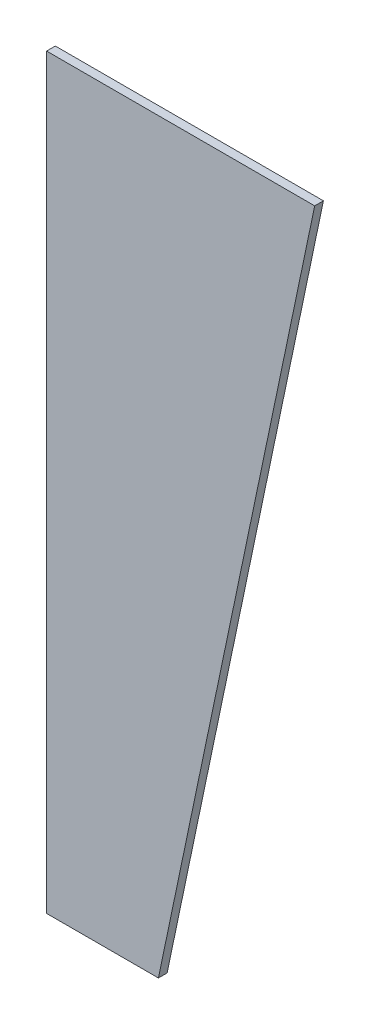
ISO-10303-21;
HEADER;
FILE_DESCRIPTION(('STEP AP214'),'2;1');
FILE_NAME('part.step','',(''),(''),'','','');
FILE_SCHEMA(('AUTOMOTIVE_DESIGN { 1 0 10303 214 1 1 1 1 }'));
ENDSEC;
DATA;
#1=APPLICATION_CONTEXT('core data for automotive mechanical design processes');
#2=APPLICATION_PROTOCOL_DEFINITION('international standard','automotive_design',2000,#1);
#3=PRODUCT_CONTEXT('',#1,'mechanical');
#4=PRODUCT('Part','Part','',(#3));
#5=PRODUCT_RELATED_PRODUCT_CATEGORY('part','',(#4));
#6=PRODUCT_DEFINITION_FORMATION('','',#4);
#7=PRODUCT_DEFINITION_CONTEXT('part definition',#1,'design');
#8=PRODUCT_DEFINITION('design','',#6,#7);
#9=PRODUCT_DEFINITION_SHAPE('','',#8);
#10=(LENGTH_UNIT() NAMED_UNIT(*) SI_UNIT(.MILLI.,.METRE.));
#11=(NAMED_UNIT(*) PLANE_ANGLE_UNIT() SI_UNIT($,.RADIAN.));
#12=(NAMED_UNIT(*) SI_UNIT($,.STERADIAN.) SOLID_ANGLE_UNIT());
#13=UNCERTAINTY_MEASURE_WITH_UNIT(LENGTH_MEASURE(1.E-05),#10,'distance_accuracy_value','');
#14=(GEOMETRIC_REPRESENTATION_CONTEXT(3) GLOBAL_UNCERTAINTY_ASSIGNED_CONTEXT((#13)) GLOBAL_UNIT_ASSIGNED_CONTEXT((#10,
#11,#12)) REPRESENTATION_CONTEXT('',''));
#15=CARTESIAN_POINT('',(0.,0.,0.));
#16=DIRECTION('',(0.,0.,1.));
#17=DIRECTION('',(1.,0.,0.));
#18=AXIS2_PLACEMENT_3D('',#15,#16,#17);
#19=CARTESIAN_POINT('',(0.,257.,3.));
#20=DIRECTION('',(0.,1.,0.));
#21=DIRECTION('',(0.,0.,1.));
#22=AXIS2_PLACEMENT_3D('',#19,#20,#21);
#23=PLANE('',#22);
#24=DIRECTION('',(1.,0.,0.));
#25=VECTOR('',#24,1.);
#26=CARTESIAN_POINT('',(0.,257.,0.));
#27=LINE('',#26,#25);
#28=CARTESIAN_POINT('',(0.,257.,0.));
#29=VERTEX_POINT('',#28);
#30=CARTESIAN_POINT('',(92.26,257.,0.));
#31=VERTEX_POINT('',#30);
#32=EDGE_CURVE('E97',#29,#31,#27,.T.);
#33=ORIENTED_EDGE('',*,*,#32,.F.);
#34=DIRECTION('',(0.,0.,-1.));
#35=VECTOR('',#34,1.);
#36=CARTESIAN_POINT('',(0.,257.,3.));
#37=LINE('',#36,#35);
#38=CARTESIAN_POINT('',(0.,257.,3.));
#39=VERTEX_POINT('',#38);
#40=EDGE_CURVE('E11',#39,#29,#37,.T.);
#41=ORIENTED_EDGE('',*,*,#40,.F.);
#42=DIRECTION('',(1.,0.,0.));
#43=VECTOR('',#42,1.);
#44=CARTESIAN_POINT('',(0.,257.,3.));
#45=LINE('',#44,#43);
#46=CARTESIAN_POINT('',(92.26,257.,3.));
#47=VERTEX_POINT('',#46);
#48=EDGE_CURVE('E91',#39,#47,#45,.T.);
#49=ORIENTED_EDGE('',*,*,#48,.T.);
#50=DIRECTION('',(0.,0.,-1.));
#51=VECTOR('',#50,1.);
#52=CARTESIAN_POINT('',(92.26,257.,3.));
#53=LINE('',#52,#51);
#54=EDGE_CURVE('E72',#47,#31,#53,.T.);
#55=ORIENTED_EDGE('',*,*,#54,.T.);
#56=EDGE_LOOP('',(#33,#41,#49,#55));
#57=FACE_BOUND('',#56,.T.);
#58=ADVANCED_FACE('F34',(#57),#23,.T.);
#59=CARTESIAN_POINT('',(0.,0.,3.));
#60=DIRECTION('',(-1.,0.,0.));
#61=DIRECTION('',(0.,0.,1.));
#62=AXIS2_PLACEMENT_3D('',#59,#60,#61);
#63=PLANE('',#62);
#64=DIRECTION('',(0.,1.,0.));
#65=VECTOR('',#64,1.);
#66=CARTESIAN_POINT('',(0.,0.,0.));
#67=LINE('',#66,#65);
#68=CARTESIAN_POINT('',(0.,0.,0.));
#69=VERTEX_POINT('',#68);
#70=EDGE_CURVE('E85',#69,#29,#67,.T.);
#71=ORIENTED_EDGE('',*,*,#70,.F.);
#72=DIRECTION('',(0.,0.,-1.));
#73=VECTOR('',#72,1.);
#74=CARTESIAN_POINT('',(0.,0.,3.));
#75=LINE('',#74,#73);
#76=CARTESIAN_POINT('',(0.,0.,3.));
#77=VERTEX_POINT('',#76);
#78=EDGE_CURVE('E42',#77,#69,#75,.T.);
#79=ORIENTED_EDGE('',*,*,#78,.F.);
#80=DIRECTION('',(0.,1.,0.));
#81=VECTOR('',#80,1.);
#82=CARTESIAN_POINT('',(0.,0.,3.));
#83=LINE('',#82,#81);
#84=EDGE_CURVE('E83',#77,#39,#83,.T.);
#85=ORIENTED_EDGE('',*,*,#84,.T.);
#86=ORIENTED_EDGE('',*,*,#40,.T.);
#87=EDGE_LOOP('',(#71,#79,#85,#86));
#88=FACE_BOUND('',#87,.T.);
#89=ADVANCED_FACE('F81',(#88),#63,.T.);
#90=CARTESIAN_POINT('',(0.,0.,3.));
#91=DIRECTION('',(0.,1.,0.));
#92=DIRECTION('',(0.,0.,1.));
#93=AXIS2_PLACEMENT_3D('',#90,#91,#92);
#94=PLANE('',#93);
#95=DIRECTION('',(1.,0.,0.));
#96=VECTOR('',#95,1.);
#97=CARTESIAN_POINT('',(0.,0.,0.));
#98=LINE('',#97,#96);
#99=CARTESIAN_POINT('',(38.48,0.,0.));
#100=VERTEX_POINT('',#99);
#101=EDGE_CURVE('E65',#69,#100,#98,.T.);
#102=ORIENTED_EDGE('',*,*,#101,.T.);
#103=DIRECTION('',(0.,0.,-1.));
#104=VECTOR('',#103,1.);
#105=CARTESIAN_POINT('',(38.48,0.,3.));
#106=LINE('',#105,#104);
#107=CARTESIAN_POINT('',(38.48,0.,3.));
#108=VERTEX_POINT('',#107);
#109=EDGE_CURVE('E86',#108,#100,#106,.T.);
#110=ORIENTED_EDGE('',*,*,#109,.F.);
#111=DIRECTION('',(1.,0.,0.));
#112=VECTOR('',#111,1.);
#113=CARTESIAN_POINT('',(0.,0.,3.));
#114=LINE('',#113,#112);
#115=EDGE_CURVE('E87',#77,#108,#114,.T.);
#116=ORIENTED_EDGE('',*,*,#115,.F.);
#117=ORIENTED_EDGE('',*,*,#78,.T.);
#118=EDGE_LOOP('',(#102,#110,#116,#117));
#119=FACE_BOUND('',#118,.T.);
#120=ADVANCED_FACE('F88',(#119),#94,.F.);
#121=CARTESIAN_POINT('',(36.865651614367,-7.71453207712318,3.));
#122=DIRECTION('',(-0.978798794122388,0.204824121198062,0.));
#123=DIRECTION('',(-0.204824121198062,-0.978798794122388,0.));
#124=AXIS2_PLACEMENT_3D('',#121,#122,#123);
#125=PLANE('',#124);
#126=DIRECTION('',(0.204824121198062,0.978798794122388,0.));
#127=VECTOR('',#126,1.);
#128=CARTESIAN_POINT('',(36.865651614367,-7.71453207712318,0.));
#129=LINE('',#128,#127);
#130=EDGE_CURVE('E93',#100,#31,#129,.T.);
#131=ORIENTED_EDGE('',*,*,#130,.T.);
#132=ORIENTED_EDGE('',*,*,#54,.F.);
#133=DIRECTION('',(0.204824121198062,0.978798794122388,0.));
#134=VECTOR('',#133,1.);
#135=CARTESIAN_POINT('',(36.865651614367,-7.71453207712318,3.));
#136=LINE('',#135,#134);
#137=EDGE_CURVE('E50',#108,#47,#136,.T.);
#138=ORIENTED_EDGE('',*,*,#137,.F.);
#139=ORIENTED_EDGE('',*,*,#109,.T.);
#140=EDGE_LOOP('',(#131,#132,#138,#139));
#141=FACE_BOUND('',#140,.T.);
#142=ADVANCED_FACE('F106',(#141),#125,.F.);
#143=CARTESIAN_POINT('',(0.,0.,3.));
#144=DIRECTION('',(0.,0.,1.));
#145=DIRECTION('',(1.,0.,0.));
#146=AXIS2_PLACEMENT_3D('',#143,#144,#145);
#147=PLANE('',#146);
#148=ORIENTED_EDGE('',*,*,#48,.F.);
#149=ORIENTED_EDGE('',*,*,#84,.F.);
#150=ORIENTED_EDGE('',*,*,#115,.T.);
#151=ORIENTED_EDGE('',*,*,#137,.T.);
#152=EDGE_LOOP('',(#148,#149,#150,#151));
#153=FACE_BOUND('',#152,.T.);
#154=ADVANCED_FACE('F90',(#153),#147,.T.);
#155=CARTESIAN_POINT('',(0.,0.,0.));
#156=DIRECTION('',(0.,0.,1.));
#157=DIRECTION('',(1.,0.,0.));
#158=AXIS2_PLACEMENT_3D('',#155,#156,#157);
#159=PLANE('',#158);
#160=ORIENTED_EDGE('',*,*,#32,.T.);
#161=ORIENTED_EDGE('',*,*,#130,.F.);
#162=ORIENTED_EDGE('',*,*,#101,.F.);
#163=ORIENTED_EDGE('',*,*,#70,.T.);
#164=EDGE_LOOP('',(#160,#161,#162,#163));
#165=FACE_BOUND('',#164,.T.);
#166=ADVANCED_FACE('F108',(#165),#159,.F.);
#167=CLOSED_SHELL('',(#58,#89,#120,#142,#154,#166));
#168=MANIFOLD_SOLID_BREP('B2',#167);
#169=ADVANCED_BREP_SHAPE_REPRESENTATION('',(#18,#168),#14);
#170=SHAPE_DEFINITION_REPRESENTATION(#9,#169);
ENDSEC;
END-ISO-10303-21;
